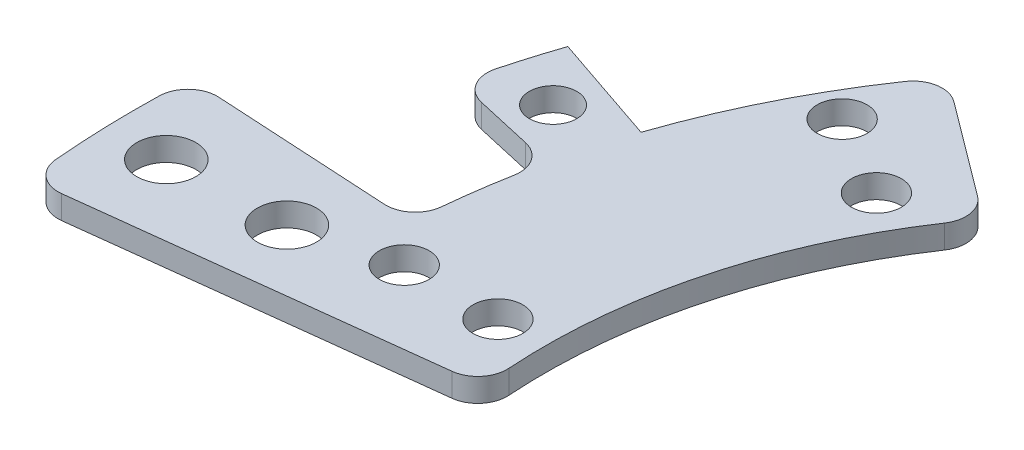
ISO-10303-21;
HEADER;
FILE_DESCRIPTION(('STEP AP214'),'2;1');
FILE_NAME('part.step','',(''),(''),'','','');
FILE_SCHEMA(('AUTOMOTIVE_DESIGN { 1 0 10303 214 1 1 1 1 }'));
ENDSEC;
DATA;
#1=APPLICATION_CONTEXT('core data for automotive mechanical design processes');
#2=APPLICATION_PROTOCOL_DEFINITION('international standard','automotive_design',2000,#1);
#3=PRODUCT_CONTEXT('',#1,'mechanical');
#4=PRODUCT('Part','Part','',(#3));
#5=PRODUCT_RELATED_PRODUCT_CATEGORY('part','',(#4));
#6=PRODUCT_DEFINITION_FORMATION('','',#4);
#7=PRODUCT_DEFINITION_CONTEXT('part definition',#1,'design');
#8=PRODUCT_DEFINITION('design','',#6,#7);
#9=PRODUCT_DEFINITION_SHAPE('','',#8);
#10=(LENGTH_UNIT() NAMED_UNIT(*) SI_UNIT(.MILLI.,.METRE.));
#11=(NAMED_UNIT(*) PLANE_ANGLE_UNIT() SI_UNIT($,.RADIAN.));
#12=(NAMED_UNIT(*) SI_UNIT($,.STERADIAN.) SOLID_ANGLE_UNIT());
#13=UNCERTAINTY_MEASURE_WITH_UNIT(LENGTH_MEASURE(1.E-05),#10,'distance_accuracy_value','');
#14=(GEOMETRIC_REPRESENTATION_CONTEXT(3) GLOBAL_UNCERTAINTY_ASSIGNED_CONTEXT((#13)) GLOBAL_UNIT_ASSIGNED_CONTEXT((#10,
#11,#12)) REPRESENTATION_CONTEXT('',''));
#15=CARTESIAN_POINT('',(0.,0.,0.));
#16=DIRECTION('',(0.,0.,1.));
#17=DIRECTION('',(1.,0.,0.));
#18=AXIS2_PLACEMENT_3D('',#15,#16,#17);
#19=CARTESIAN_POINT('',(0.,2.,0.));
#20=DIRECTION('',(0.,-1.,0.));
#21=DIRECTION('',(0.,0.,-1.));
#22=AXIS2_PLACEMENT_3D('',#19,#20,#21);
#23=CYLINDRICAL_SURFACE('',#22,62.);
#24=CARTESIAN_POINT('',(0.,0.,0.));
#25=DIRECTION('',(0.,1.,0.));
#26=DIRECTION('',(0.,0.,1.));
#27=AXIS2_PLACEMENT_3D('',#24,#25,#26);
#28=CIRCLE('',#27,62.);
#29=CARTESIAN_POINT('',(-60.9548901885019,0.,-11.3358441285893));
#30=VERTEX_POINT('',#29);
#31=CARTESIAN_POINT('',(-61.7181832198914,0.,-5.90473200373407));
#32=VERTEX_POINT('',#31);
#33=EDGE_CURVE('E240',#30,#32,#28,.T.);
#34=ORIENTED_EDGE('',*,*,#33,.T.);
#35=DIRECTION('',(0.,-1.,0.));
#36=VECTOR('',#35,1.);
#37=CARTESIAN_POINT('',(-61.7181832198913,2.,-5.90473200373407));
#38=LINE('',#37,#36);
#39=CARTESIAN_POINT('',(-61.7181832198914,2.,-5.90473200373407));
#40=VERTEX_POINT('',#39);
#41=EDGE_CURVE('E251',#32,#40,#38,.F.);
#42=ORIENTED_EDGE('',*,*,#41,.T.);
#43=CARTESIAN_POINT('',(0.,2.,0.));
#44=DIRECTION('',(0.,1.,0.));
#45=DIRECTION('',(0.,0.,1.));
#46=AXIS2_PLACEMENT_3D('',#43,#44,#45);
#47=CIRCLE('',#46,62.);
#48=CARTESIAN_POINT('',(-60.9548901885019,2.,-11.3358441285893));
#49=VERTEX_POINT('',#48);
#50=EDGE_CURVE('E174',#49,#40,#47,.T.);
#51=ORIENTED_EDGE('',*,*,#50,.F.);
#52=DIRECTION('',(0.,-1.,0.));
#53=VECTOR('',#52,1.);
#54=CARTESIAN_POINT('',(-60.9548901885019,2.,-11.3358441285893));
#55=LINE('',#54,#53);
#56=EDGE_CURVE('E248',#49,#30,#55,.T.);
#57=ORIENTED_EDGE('',*,*,#56,.T.);
#58=EDGE_LOOP('',(#34,#42,#51,#57));
#59=FACE_BOUND('',#58,.T.);
#60=ADVANCED_FACE('F35',(#59),#23,.T.);
#61=CARTESIAN_POINT('',(-51.1886642708847,2.,-34.9817187994337));
#62=VERTEX_POINT('',#61);
#63=CARTESIAN_POINT('',(-58.7074669335232,2.,-19.9357298900562));
#64=VERTEX_POINT('',#63);
#65=EDGE_CURVE('E160',#62,#64,#47,.T.);
#66=ORIENTED_EDGE('',*,*,#65,.F.);
#67=DIRECTION('',(0.,-1.,0.));
#68=VECTOR('',#67,1.);
#69=CARTESIAN_POINT('',(-51.1886642708847,2.,-34.9817187994337));
#70=LINE('',#69,#68);
#71=CARTESIAN_POINT('',(-51.1886642708847,0.,-34.9817187994337));
#72=VERTEX_POINT('',#71);
#73=EDGE_CURVE('E301',#62,#72,#70,.T.);
#74=ORIENTED_EDGE('',*,*,#73,.T.);
#75=CARTESIAN_POINT('',(-58.7074669335232,0.,-19.9357298900562));
#76=VERTEX_POINT('',#75);
#77=EDGE_CURVE('E189',#72,#76,#28,.T.);
#78=ORIENTED_EDGE('',*,*,#77,.T.);
#79=DIRECTION('',(0.,-1.,0.));
#80=VECTOR('',#79,1.);
#81=CARTESIAN_POINT('',(-58.7074669335232,16.9037007182661,-19.9357298900562));
#82=LINE('',#81,#80);
#83=EDGE_CURVE('E181',#64,#76,#82,.T.);
#84=ORIENTED_EDGE('',*,*,#83,.F.);
#85=EDGE_LOOP('',(#66,#74,#78,#84));
#86=FACE_BOUND('',#85,.T.);
#87=ADVANCED_FACE('F187',(#86),#23,.T.);
#88=CARTESIAN_POINT('',(0.,2.,0.));
#89=DIRECTION('',(0.,1.,0.));
#90=DIRECTION('',(0.,0.,1.));
#91=AXIS2_PLACEMENT_3D('',#88,#89,#90);
#92=PLANE('',#91);
#93=CARTESIAN_POINT('',(-64.4824921580959,2.,-18.1936308932854));
#94=DIRECTION('',(0.,1.,0.));
#95=DIRECTION('',(0.,0.,1.));
#96=AXIS2_PLACEMENT_3D('',#93,#94,#95);
#97=CIRCLE('',#96,2.02499999999999);
#98=CARTESIAN_POINT('',(-64.4824921580959,2.,-16.1686308932854));
#99=VERTEX_POINT('',#98);
#100=EDGE_CURVE('E191',#99,#99,#97,.T.);
#101=ORIENTED_EDGE('',*,*,#100,.F.);
#102=EDGE_LOOP('',(#101));
#103=FACE_BOUND('',#102,.T.);
#104=CARTESIAN_POINT('',(-44.1672955930063,2.,-25.5));
#105=DIRECTION('',(0.,1.,0.));
#106=DIRECTION('',(0.,0.,1.));
#107=AXIS2_PLACEMENT_3D('',#104,#105,#106);
#108=CIRCLE('',#107,2.125);
#109=CARTESIAN_POINT('',(-44.1672955930063,2.,-23.375));
#110=VERTEX_POINT('',#109);
#111=EDGE_CURVE('E208',#110,#110,#108,.T.);
#112=ORIENTED_EDGE('',*,*,#111,.F.);
#113=EDGE_LOOP('',(#112));
#114=FACE_BOUND('',#113,.T.);
#115=CARTESIAN_POINT('',(-51.0954988232818,2.,-29.5));
#116=DIRECTION('',(0.,1.,0.));
#117=DIRECTION('',(0.,0.,1.));
#118=AXIS2_PLACEMENT_3D('',#115,#116,#117);
#119=CIRCLE('',#118,2.125);
#120=CARTESIAN_POINT('',(-51.0954988232818,2.,-27.3750000000001));
#121=VERTEX_POINT('',#120);
#122=EDGE_CURVE('E220',#121,#121,#119,.T.);
#123=ORIENTED_EDGE('',*,*,#122,.F.);
#124=EDGE_LOOP('',(#123));
#125=FACE_BOUND('',#124,.T.);
#126=CARTESIAN_POINT('',(0.,2.,0.));
#127=DIRECTION('',(0.,1.,0.));
#128=DIRECTION('',(0.,0.,1.));
#129=AXIS2_PLACEMENT_3D('',#126,#127,#128);
#130=CIRCLE('',#129,82.);
#131=CARTESIAN_POINT('',(-81.9740451592876,2.,-2.06298817812173));
#132=VERTEX_POINT('',#131);
#133=CARTESIAN_POINT('',(-81.6936426156601,2.,7.08157865061171));
#134=VERTEX_POINT('',#133);
#135=EDGE_CURVE('E339',#132,#134,#130,.T.);
#136=ORIENTED_EDGE('',*,*,#135,.T.);
#137=CARTESIAN_POINT('',(-79.2029827798168,2.,6.86567686248331));
#138=DIRECTION('',(0.,1.,0.));
#139=DIRECTION('',(0.,0.,1.));
#140=AXIS2_PLACEMENT_3D('',#137,#138,#139);
#141=CIRCLE('',#140,2.5);
#142=CARTESIAN_POINT('',(-78.908865132758,2.,9.34831554132656));
#143=VERTEX_POINT('',#142);
#144=EDGE_CURVE('E283',#134,#143,#141,.T.);
#145=ORIENTED_EDGE('',*,*,#144,.T.);
#146=DIRECTION('',(0.993055471537302,0.,-0.117647058823529));
#147=VECTOR('',#146,1.);
#148=CARTESIAN_POINT('',(-46.6736071622532,2.,5.52941176470589));
#149=LINE('',#148,#147);
#150=CARTESIAN_POINT('',(-49.0935129154619,2.,5.81609745614508));
#151=VERTEX_POINT('',#150);
#152=EDGE_CURVE('E173',#143,#151,#149,.T.);
#153=ORIENTED_EDGE('',*,*,#152,.T.);
#154=CARTESIAN_POINT('',(-49.3876305625207,2.,3.33345877730183));
#155=DIRECTION('',(0.,1.,0.));
#156=DIRECTION('',(0.,0.,1.));
#157=AXIS2_PLACEMENT_3D('',#154,#155,#156);
#158=CIRCLE('',#157,2.5);
#159=CARTESIAN_POINT('',(-46.8933057866358,2.,3.16510227339769));
#160=VERTEX_POINT('',#159);
#161=EDGE_CURVE('E281',#151,#160,#158,.T.);
#162=ORIENTED_EDGE('',*,*,#161,.T.);
#163=CARTESIAN_POINT('',(0.,2.,0.));
#164=DIRECTION('',(0.,-1.,0.));
#165=DIRECTION('',(0.,0.,1.));
#166=AXIS2_PLACEMENT_3D('',#163,#164,#165);
#167=CIRCLE('',#166,47.);
#168=CARTESIAN_POINT('',(-39.0282429419596,2.,-26.1877118676562));
#169=VERTEX_POINT('',#168);
#170=EDGE_CURVE('E226',#160,#169,#167,.T.);
#171=ORIENTED_EDGE('',*,*,#170,.T.);
#172=CARTESIAN_POINT('',(-41.1042133112127,2.,-27.580675264872));
#173=DIRECTION('',(0.,1.,0.));
#174=DIRECTION('',(0.,0.,1.));
#175=AXIS2_PLACEMENT_3D('',#172,#173,#174);
#176=CIRCLE('',#175,2.5);
#177=CARTESIAN_POINT('',(-39.6081806177369,2.,-29.5836446056387));
#178=VERTEX_POINT('',#177);
#179=EDGE_CURVE('E276',#169,#178,#176,.T.);
#180=ORIENTED_EDGE('',*,*,#179,.T.);
#181=DIRECTION('',(-0.801187736306673,0.,-0.59841307739035));
#182=VECTOR('',#181,1.);
#183=CARTESIAN_POINT('',(-37.6558236064136,2.,-28.1254146373465));
#184=LINE('',#183,#182);
#185=CARTESIAN_POINT('',(-47.628572534228,2.,-35.5741349628039));
#186=VERTEX_POINT('',#185);
#187=EDGE_CURVE('E229',#178,#186,#184,.T.);
#188=ORIENTED_EDGE('',*,*,#187,.T.);
#189=CARTESIAN_POINT('',(-49.1246052277038,2.,-33.5711656220372));
#190=DIRECTION('',(0.,1.,0.));
#191=DIRECTION('',(0.,0.,1.));
#192=AXIS2_PLACEMENT_3D('',#189,#190,#191);
#193=CIRCLE('',#192,2.5);
#194=EDGE_CURVE('E168',#186,#62,#193,.T.);
#195=ORIENTED_EDGE('',*,*,#194,.T.);
#196=ORIENTED_EDGE('',*,*,#65,.T.);
#197=DIRECTION('',(-0.946894627960051,0.,-0.321544030484779));
#198=VECTOR('',#197,1.);
#199=CARTESIAN_POINT('',(-68.1764132131237,2.,-23.151170194904));
#200=LINE('',#199,#198);
#201=CARTESIAN_POINT('',(-68.1764132131237,2.,-23.151170194904));
#202=VERTEX_POINT('',#201);
#203=EDGE_CURVE('E165',#64,#202,#200,.T.);
#204=ORIENTED_EDGE('',*,*,#203,.T.);
#205=CARTESIAN_POINT('',(0.,2.,0.));
#206=DIRECTION('',(0.,1.,0.));
#207=DIRECTION('',(0.,0.,1.));
#208=AXIS2_PLACEMENT_3D('',#205,#206,#207);
#209=CIRCLE('',#208,72.);
#210=CARTESIAN_POINT('',(-69.6055760884792,2.,-18.4136845142664));
#211=VERTEX_POINT('',#210);
#212=EDGE_CURVE('E184',#202,#211,#209,.T.);
#213=ORIENTED_EDGE('',*,*,#212,.T.);
#214=CARTESIAN_POINT('',(-67.1887158076292,2.,-17.7743204686321));
#215=DIRECTION('',(0.,1.,0.));
#216=DIRECTION('',(0.,0.,1.));
#217=AXIS2_PLACEMENT_3D('',#214,#215,#216);
#218=CIRCLE('',#217,2.5);
#219=CARTESIAN_POINT('',(-67.7407286533917,2.,-15.3360256099013));
#220=VERTEX_POINT('',#219);
#221=EDGE_CURVE('E57',#211,#220,#218,.T.);
#222=ORIENTED_EDGE('',*,*,#221,.T.);
#223=DIRECTION('',(0.975317943492328,0.,0.220805138305015));
#224=VECTOR('',#223,1.);
#225=CARTESIAN_POINT('',(-70.2228919314476,2.,-15.897969957961));
#226=LINE('',#225,#224);
#227=CARTESIAN_POINT('',(-62.8607358180822,2.,-14.2312294763762));
#228=VERTEX_POINT('',#227);
#229=EDGE_CURVE('E185',#220,#228,#226,.T.);
#230=ORIENTED_EDGE('',*,*,#229,.T.);
#231=CARTESIAN_POINT('',(-63.4127486638447,2.,-11.7929346176453));
#232=DIRECTION('',(0.,1.,0.));
#233=DIRECTION('',(0.,0.,1.));
#234=AXIS2_PLACEMENT_3D('',#231,#232,#233);
#235=CIRCLE('',#234,2.5);
#236=EDGE_CURVE('E11',#228,#49,#235,.F.);
#237=ORIENTED_EDGE('',*,*,#236,.T.);
#238=ORIENTED_EDGE('',*,*,#50,.T.);
#239=CARTESIAN_POINT('',(-64.2068196400483,2.,-6.1428260361427));
#240=DIRECTION('',(0.,1.,0.));
#241=DIRECTION('',(0.,0.,1.));
#242=AXIS2_PLACEMENT_3D('',#239,#240,#241);
#243=CIRCLE('',#242,2.5);
#244=CARTESIAN_POINT('',(-64.3482759833136,2.,-3.64683122385843));
#245=VERTEX_POINT('',#244);
#246=EDGE_CURVE('E305',#40,#245,#243,.F.);
#247=ORIENTED_EDGE('',*,*,#246,.T.);
#248=DIRECTION('',(-0.998397924913709,0.,-0.0565825373061267));
#249=VECTOR('',#248,1.);
#250=CARTESIAN_POINT('',(-81.8686298429242,2.,-4.63976805910239));
#251=LINE('',#250,#249);
#252=CARTESIAN_POINT('',(-79.3333801221416,2.,-4.49608700936571));
#253=VERTEX_POINT('',#252);
#254=EDGE_CURVE('E331',#245,#253,#251,.T.);
#255=ORIENTED_EDGE('',*,*,#254,.T.);
#256=CARTESIAN_POINT('',(-79.4748364654069,2.,-2.00009219708143));
#257=DIRECTION('',(0.,1.,0.));
#258=DIRECTION('',(0.,0.,1.));
#259=AXIS2_PLACEMENT_3D('',#256,#257,#258);
#260=CIRCLE('',#259,2.5);
#261=EDGE_CURVE('E279',#253,#132,#260,.T.);
#262=ORIENTED_EDGE('',*,*,#261,.T.);
#263=EDGE_LOOP('',(#136,#145,#153,#162,#171,#180,#188,#195,#196,#204,#213,#222,#230,#237,#238,
#247,#255,#262));
#264=FACE_BOUND('',#263,.T.);
#265=CARTESIAN_POINT('',(-59.,2.,0.));
#266=DIRECTION('',(0.,1.,0.));
#267=DIRECTION('',(0.,0.,1.));
#268=AXIS2_PLACEMENT_3D('',#265,#266,#267);
#269=CIRCLE('',#268,2.125);
#270=CARTESIAN_POINT('',(-59.,2.,2.12500000000001));
#271=VERTEX_POINT('',#270);
#272=EDGE_CURVE('E214',#271,#271,#269,.T.);
#273=ORIENTED_EDGE('',*,*,#272,.F.);
#274=EDGE_LOOP('',(#273));
#275=FACE_BOUND('',#274,.T.);
#276=CARTESIAN_POINT('',(-51.,2.,0.));
#277=DIRECTION('',(0.,1.,0.));
#278=DIRECTION('',(0.,0.,1.));
#279=AXIS2_PLACEMENT_3D('',#276,#277,#278);
#280=CIRCLE('',#279,2.125);
#281=CARTESIAN_POINT('',(-51.,2.,2.12500000000001));
#282=VERTEX_POINT('',#281);
#283=EDGE_CURVE('E201',#282,#282,#280,.T.);
#284=ORIENTED_EDGE('',*,*,#283,.F.);
#285=EDGE_LOOP('',(#284));
#286=FACE_BOUND('',#285,.T.);
#287=CARTESIAN_POINT('',(-66.9685242341701,2.,2.05347556532022));
#288=DIRECTION('',(0.,1.,0.));
#289=DIRECTION('',(0.,0.,1.));
#290=AXIS2_PLACEMENT_3D('',#287,#288,#289);
#291=CIRCLE('',#290,2.52499999999999);
#292=CARTESIAN_POINT('',(-66.9685242341701,2.,4.57847556532022));
#293=VERTEX_POINT('',#292);
#294=EDGE_CURVE('E355',#293,#293,#291,.T.);
#295=ORIENTED_EDGE('',*,*,#294,.F.);
#296=EDGE_LOOP('',(#295));
#297=FACE_BOUND('',#296,.T.);
#298=CARTESIAN_POINT('',(-76.9638263586731,2.,2.35996445566653));
#299=DIRECTION('',(0.,1.,0.));
#300=DIRECTION('',(0.,0.,1.));
#301=AXIS2_PLACEMENT_3D('',#298,#299,#300);
#302=CIRCLE('',#301,2.52499999999999);
#303=CARTESIAN_POINT('',(-76.9638263586731,2.,4.88496445566652));
#304=VERTEX_POINT('',#303);
#305=EDGE_CURVE('E344',#304,#304,#302,.T.);
#306=ORIENTED_EDGE('',*,*,#305,.F.);
#307=EDGE_LOOP('',(#306));
#308=FACE_BOUND('',#307,.T.);
#309=ADVANCED_FACE('F163',(#103,#114,#125,#264,#275,#286,#297,#308),#92,.T.);
#310=CARTESIAN_POINT('',(0.,0.,0.));
#311=DIRECTION('',(0.,1.,0.));
#312=DIRECTION('',(0.,0.,1.));
#313=AXIS2_PLACEMENT_3D('',#310,#311,#312);
#314=PLANE('',#313);
#315=CARTESIAN_POINT('',(-64.4824921580959,0.,-18.1936308932854));
#316=DIRECTION('',(0.,1.,0.));
#317=DIRECTION('',(0.,0.,1.));
#318=AXIS2_PLACEMENT_3D('',#315,#316,#317);
#319=CIRCLE('',#318,2.02499999999999);
#320=CARTESIAN_POINT('',(-64.4824921580959,0.,-16.1686308932854));
#321=VERTEX_POINT('',#320);
#322=EDGE_CURVE('E195',#321,#321,#319,.T.);
#323=ORIENTED_EDGE('',*,*,#322,.T.);
#324=EDGE_LOOP('',(#323));
#325=FACE_BOUND('',#324,.T.);
#326=DIRECTION('',(0.993055471537302,0.,-0.117647058823529));
#327=VECTOR('',#326,1.);
#328=CARTESIAN_POINT('',(-46.6736071622532,0.,5.52941176470589));
#329=LINE('',#328,#327);
#330=CARTESIAN_POINT('',(-78.908865132758,0.,9.34831554132656));
#331=VERTEX_POINT('',#330);
#332=CARTESIAN_POINT('',(-49.0935129154619,0.,5.81609745614508));
#333=VERTEX_POINT('',#332);
#334=EDGE_CURVE('E230',#331,#333,#329,.T.);
#335=ORIENTED_EDGE('',*,*,#334,.F.);
#336=CARTESIAN_POINT('',(-79.2029827798168,0.,6.86567686248331));
#337=DIRECTION('',(0.,1.,0.));
#338=DIRECTION('',(0.,0.,1.));
#339=AXIS2_PLACEMENT_3D('',#336,#337,#338);
#340=CIRCLE('',#339,2.5);
#341=CARTESIAN_POINT('',(-81.6936426156601,0.,7.08157865061171));
#342=VERTEX_POINT('',#341);
#343=EDGE_CURVE('E268',#331,#342,#340,.F.);
#344=ORIENTED_EDGE('',*,*,#343,.T.);
#345=CARTESIAN_POINT('',(0.,0.,0.));
#346=DIRECTION('',(0.,1.,0.));
#347=DIRECTION('',(0.,0.,-1.));
#348=AXIS2_PLACEMENT_3D('',#345,#346,#347);
#349=CIRCLE('',#348,82.);
#350=CARTESIAN_POINT('',(-81.9740451592876,0.,-2.06298817812173));
#351=VERTEX_POINT('',#350);
#352=EDGE_CURVE('E352',#351,#342,#349,.T.);
#353=ORIENTED_EDGE('',*,*,#352,.F.);
#354=CARTESIAN_POINT('',(-79.4748364654069,0.,-2.00009219708143));
#355=DIRECTION('',(0.,1.,0.));
#356=DIRECTION('',(0.,0.,1.));
#357=AXIS2_PLACEMENT_3D('',#354,#355,#356);
#358=CIRCLE('',#357,2.5);
#359=CARTESIAN_POINT('',(-79.3333801221416,0.,-4.49608700936571));
#360=VERTEX_POINT('',#359);
#361=EDGE_CURVE('E264',#351,#360,#358,.F.);
#362=ORIENTED_EDGE('',*,*,#361,.T.);
#363=DIRECTION('',(-0.998397924913709,0.,-0.0565825373061267));
#364=VECTOR('',#363,1.);
#365=CARTESIAN_POINT('',(-81.8686298429242,0.,-4.63976805910239));
#366=LINE('',#365,#364);
#367=CARTESIAN_POINT('',(-64.3482759833136,0.,-3.64683122385843));
#368=VERTEX_POINT('',#367);
#369=EDGE_CURVE('E350',#368,#360,#366,.T.);
#370=ORIENTED_EDGE('',*,*,#369,.F.);
#371=CARTESIAN_POINT('',(-64.2068196400483,0.,-6.1428260361427));
#372=DIRECTION('',(0.,1.,0.));
#373=DIRECTION('',(0.,0.,1.));
#374=AXIS2_PLACEMENT_3D('',#371,#372,#373);
#375=CIRCLE('',#374,2.5);
#376=EDGE_CURVE('E303',#368,#32,#375,.T.);
#377=ORIENTED_EDGE('',*,*,#376,.T.);
#378=ORIENTED_EDGE('',*,*,#33,.F.);
#379=CARTESIAN_POINT('',(-63.4127486638447,0.,-11.7929346176453));
#380=DIRECTION('',(0.,1.,0.));
#381=DIRECTION('',(0.,0.,1.));
#382=AXIS2_PLACEMENT_3D('',#379,#380,#381);
#383=CIRCLE('',#382,2.5);
#384=CARTESIAN_POINT('',(-62.8607358180822,0.,-14.2312294763762));
#385=VERTEX_POINT('',#384);
#386=EDGE_CURVE('E43',#30,#385,#383,.T.);
#387=ORIENTED_EDGE('',*,*,#386,.T.);
#388=DIRECTION('',(0.975317943492328,0.,0.220805138305015));
#389=VECTOR('',#388,1.);
#390=CARTESIAN_POINT('',(-70.2228919314476,0.,-15.897969957961));
#391=LINE('',#390,#389);
#392=CARTESIAN_POINT('',(-67.7407286533917,0.,-15.3360256099013));
#393=VERTEX_POINT('',#392);
#394=EDGE_CURVE('E312',#393,#385,#391,.T.);
#395=ORIENTED_EDGE('',*,*,#394,.F.);
#396=CARTESIAN_POINT('',(-67.1887158076292,0.,-17.7743204686321));
#397=DIRECTION('',(0.,1.,0.));
#398=DIRECTION('',(0.,0.,1.));
#399=AXIS2_PLACEMENT_3D('',#396,#397,#398);
#400=CIRCLE('',#399,2.5);
#401=CARTESIAN_POINT('',(-69.6055760884792,0.,-18.4136845142664));
#402=VERTEX_POINT('',#401);
#403=EDGE_CURVE('E262',#393,#402,#400,.F.);
#404=ORIENTED_EDGE('',*,*,#403,.T.);
#405=CARTESIAN_POINT('',(0.,0.,0.));
#406=DIRECTION('',(0.,1.,0.));
#407=DIRECTION('',(0.,0.,-1.));
#408=AXIS2_PLACEMENT_3D('',#405,#406,#407);
#409=CIRCLE('',#408,72.);
#410=CARTESIAN_POINT('',(-68.1764132131237,0.,-23.151170194904));
#411=VERTEX_POINT('',#410);
#412=EDGE_CURVE('E200',#411,#402,#409,.T.);
#413=ORIENTED_EDGE('',*,*,#412,.F.);
#414=DIRECTION('',(-0.946894627960051,0.,-0.321544030484779));
#415=VECTOR('',#414,1.);
#416=CARTESIAN_POINT('',(-68.1764132131237,0.,-23.151170194904));
#417=LINE('',#416,#415);
#418=EDGE_CURVE('E190',#76,#411,#417,.T.);
#419=ORIENTED_EDGE('',*,*,#418,.F.);
#420=ORIENTED_EDGE('',*,*,#77,.F.);
#421=CARTESIAN_POINT('',(-49.1246052277038,0.,-33.5711656220372));
#422=DIRECTION('',(0.,1.,0.));
#423=DIRECTION('',(0.,0.,1.));
#424=AXIS2_PLACEMENT_3D('',#421,#422,#423);
#425=CIRCLE('',#424,2.5);
#426=CARTESIAN_POINT('',(-47.628572534228,0.,-35.5741349628039));
#427=VERTEX_POINT('',#426);
#428=EDGE_CURVE('E258',#72,#427,#425,.F.);
#429=ORIENTED_EDGE('',*,*,#428,.T.);
#430=DIRECTION('',(-0.801187736306673,0.,-0.59841307739035));
#431=VECTOR('',#430,1.);
#432=CARTESIAN_POINT('',(-37.6558236064136,0.,-28.1254146373465));
#433=LINE('',#432,#431);
#434=CARTESIAN_POINT('',(-39.6081806177369,0.,-29.5836446056387));
#435=VERTEX_POINT('',#434);
#436=EDGE_CURVE('E237',#435,#427,#433,.T.);
#437=ORIENTED_EDGE('',*,*,#436,.F.);
#438=CARTESIAN_POINT('',(-41.1042133112127,0.,-27.580675264872));
#439=DIRECTION('',(0.,1.,0.));
#440=DIRECTION('',(0.,0.,1.));
#441=AXIS2_PLACEMENT_3D('',#438,#439,#440);
#442=CIRCLE('',#441,2.5);
#443=CARTESIAN_POINT('',(-39.0282429419596,0.,-26.1877118676562));
#444=VERTEX_POINT('',#443);
#445=EDGE_CURVE('E260',#435,#444,#442,.F.);
#446=ORIENTED_EDGE('',*,*,#445,.T.);
#447=CARTESIAN_POINT('',(0.,0.,0.));
#448=DIRECTION('',(0.,-1.,0.));
#449=DIRECTION('',(0.,0.,1.));
#450=AXIS2_PLACEMENT_3D('',#447,#448,#449);
#451=CIRCLE('',#450,47.);
#452=CARTESIAN_POINT('',(-46.8933057866358,0.,3.16510227339769));
#453=VERTEX_POINT('',#452);
#454=EDGE_CURVE('E223',#453,#444,#451,.T.);
#455=ORIENTED_EDGE('',*,*,#454,.F.);
#456=CARTESIAN_POINT('',(-49.3876305625207,0.,3.33345877730183));
#457=DIRECTION('',(0.,1.,0.));
#458=DIRECTION('',(0.,0.,1.));
#459=AXIS2_PLACEMENT_3D('',#456,#457,#458);
#460=CIRCLE('',#459,2.5);
#461=EDGE_CURVE('E266',#453,#333,#460,.F.);
#462=ORIENTED_EDGE('',*,*,#461,.T.);
#463=EDGE_LOOP('',(#335,#344,#353,#362,#370,#377,#378,#387,#395,#404,#413,#419,#420,#429,#437,
#446,#455,#462));
#464=FACE_BOUND('',#463,.T.);
#465=CARTESIAN_POINT('',(-51.0954988232818,0.,-29.5));
#466=DIRECTION('',(0.,1.,0.));
#467=DIRECTION('',(0.,0.,1.));
#468=AXIS2_PLACEMENT_3D('',#465,#466,#467);
#469=CIRCLE('',#468,2.125);
#470=CARTESIAN_POINT('',(-51.0954988232818,0.,-27.3750000000001));
#471=VERTEX_POINT('',#470);
#472=EDGE_CURVE('E217',#471,#471,#469,.T.);
#473=ORIENTED_EDGE('',*,*,#472,.T.);
#474=EDGE_LOOP('',(#473));
#475=FACE_BOUND('',#474,.T.);
#476=CARTESIAN_POINT('',(-59.,0.,0.));
#477=DIRECTION('',(0.,1.,0.));
#478=DIRECTION('',(0.,0.,1.));
#479=AXIS2_PLACEMENT_3D('',#476,#477,#478);
#480=CIRCLE('',#479,2.125);
#481=CARTESIAN_POINT('',(-59.,0.,2.12500000000001));
#482=VERTEX_POINT('',#481);
#483=EDGE_CURVE('E211',#482,#482,#480,.T.);
#484=ORIENTED_EDGE('',*,*,#483,.T.);
#485=EDGE_LOOP('',(#484));
#486=FACE_BOUND('',#485,.T.);
#487=CARTESIAN_POINT('',(-44.1672955930063,0.,-25.5));
#488=DIRECTION('',(0.,1.,0.));
#489=DIRECTION('',(0.,0.,1.));
#490=AXIS2_PLACEMENT_3D('',#487,#488,#489);
#491=CIRCLE('',#490,2.125);
#492=CARTESIAN_POINT('',(-44.1672955930063,0.,-23.375));
#493=VERTEX_POINT('',#492);
#494=EDGE_CURVE('E204',#493,#493,#491,.T.);
#495=ORIENTED_EDGE('',*,*,#494,.T.);
#496=EDGE_LOOP('',(#495));
#497=FACE_BOUND('',#496,.T.);
#498=CARTESIAN_POINT('',(-51.,0.,0.));
#499=DIRECTION('',(0.,1.,0.));
#500=DIRECTION('',(0.,0.,1.));
#501=AXIS2_PLACEMENT_3D('',#498,#499,#500);
#502=CIRCLE('',#501,2.125);
#503=CARTESIAN_POINT('',(-51.,0.,2.12500000000001));
#504=VERTEX_POINT('',#503);
#505=EDGE_CURVE('E205',#504,#504,#502,.T.);
#506=ORIENTED_EDGE('',*,*,#505,.T.);
#507=EDGE_LOOP('',(#506));
#508=FACE_BOUND('',#507,.T.);
#509=CARTESIAN_POINT('',(-76.9638263586731,0.,2.35996445566653));
#510=DIRECTION('',(0.,1.,0.));
#511=DIRECTION('',(0.,0.,1.));
#512=AXIS2_PLACEMENT_3D('',#509,#510,#511);
#513=CIRCLE('',#512,2.52499999999999);
#514=CARTESIAN_POINT('',(-76.9638263586731,0.,4.88496445566652));
#515=VERTEX_POINT('',#514);
#516=EDGE_CURVE('E342',#515,#515,#513,.T.);
#517=ORIENTED_EDGE('',*,*,#516,.T.);
#518=EDGE_LOOP('',(#517));
#519=FACE_BOUND('',#518,.T.);
#520=CARTESIAN_POINT('',(-66.9685242341701,0.,2.05347556532022));
#521=DIRECTION('',(0.,1.,0.));
#522=DIRECTION('',(0.,0.,1.));
#523=AXIS2_PLACEMENT_3D('',#520,#521,#522);
#524=CIRCLE('',#523,2.52499999999999);
#525=CARTESIAN_POINT('',(-66.9685242341701,0.,4.57847556532022));
#526=VERTEX_POINT('',#525);
#527=EDGE_CURVE('E338',#526,#526,#524,.T.);
#528=ORIENTED_EDGE('',*,*,#527,.T.);
#529=EDGE_LOOP('',(#528));
#530=FACE_BOUND('',#529,.T.);
#531=ADVANCED_FACE('F310',(#325,#464,#475,#486,#497,#508,#519,#530),#314,.F.);
#532=CARTESIAN_POINT('',(0.,2.,0.));
#533=DIRECTION('',(0.,-1.,0.));
#534=DIRECTION('',(0.,0.,-1.));
#535=AXIS2_PLACEMENT_3D('',#532,#533,#534);
#536=CYLINDRICAL_SURFACE('',#535,47.);
#537=ORIENTED_EDGE('',*,*,#170,.F.);
#538=DIRECTION('',(0.,-1.,0.));
#539=VECTOR('',#538,1.);
#540=CARTESIAN_POINT('',(-46.8933057866358,2.,3.16510227339769));
#541=LINE('',#540,#539);
#542=EDGE_CURVE('E287',#160,#453,#541,.T.);
#543=ORIENTED_EDGE('',*,*,#542,.T.);
#544=ORIENTED_EDGE('',*,*,#454,.T.);
#545=DIRECTION('',(0.,-1.,0.));
#546=VECTOR('',#545,1.);
#547=CARTESIAN_POINT('',(-39.0282429419596,2.,-26.1877118676562));
#548=LINE('',#547,#546);
#549=EDGE_CURVE('E285',#444,#169,#548,.F.);
#550=ORIENTED_EDGE('',*,*,#549,.T.);
#551=EDGE_LOOP('',(#537,#543,#544,#550));
#552=FACE_BOUND('',#551,.T.);
#553=ADVANCED_FACE('F392',(#552),#536,.F.);
#554=CARTESIAN_POINT('',(-37.6558236064136,2.,-28.1254146373465));
#555=DIRECTION('',(-0.59841307739035,0.,0.801187736306673));
#556=DIRECTION('',(0.801187736306673,0.,0.59841307739035));
#557=AXIS2_PLACEMENT_3D('',#554,#555,#556);
#558=PLANE('',#557);
#559=ORIENTED_EDGE('',*,*,#187,.F.);
#560=DIRECTION('',(0.,-1.,0.));
#561=VECTOR('',#560,1.);
#562=CARTESIAN_POINT('',(-39.6081806177369,2.,-29.5836446056387));
#563=LINE('',#562,#561);
#564=EDGE_CURVE('E298',#178,#435,#563,.T.);
#565=ORIENTED_EDGE('',*,*,#564,.T.);
#566=ORIENTED_EDGE('',*,*,#436,.T.);
#567=DIRECTION('',(0.,-1.,0.));
#568=VECTOR('',#567,1.);
#569=CARTESIAN_POINT('',(-47.628572534228,2.,-35.5741349628039));
#570=LINE('',#569,#568);
#571=EDGE_CURVE('E296',#427,#186,#570,.F.);
#572=ORIENTED_EDGE('',*,*,#571,.T.);
#573=EDGE_LOOP('',(#559,#565,#566,#572));
#574=FACE_BOUND('',#573,.T.);
#575=ADVANCED_FACE('F373',(#574),#558,.F.);
#576=CARTESIAN_POINT('',(-46.6736071622532,2.,5.52941176470589));
#577=DIRECTION('',(-0.117647058823529,0.,-0.993055471537302));
#578=DIRECTION('',(-0.993055471537302,0.,0.117647058823529));
#579=AXIS2_PLACEMENT_3D('',#576,#577,#578);
#580=PLANE('',#579);
#581=ORIENTED_EDGE('',*,*,#152,.F.);
#582=DIRECTION('',(0.,-1.,0.));
#583=VECTOR('',#582,1.);
#584=CARTESIAN_POINT('',(-78.908865132758,2.,9.34831554132656));
#585=LINE('',#584,#583);
#586=EDGE_CURVE('E255',#143,#331,#585,.T.);
#587=ORIENTED_EDGE('',*,*,#586,.T.);
#588=ORIENTED_EDGE('',*,*,#334,.T.);
#589=DIRECTION('',(0.,-1.,0.));
#590=VECTOR('',#589,1.);
#591=CARTESIAN_POINT('',(-49.0935129154619,2.,5.81609745614508));
#592=LINE('',#591,#590);
#593=EDGE_CURVE('E253',#333,#151,#592,.F.);
#594=ORIENTED_EDGE('',*,*,#593,.T.);
#595=EDGE_LOOP('',(#581,#587,#588,#594));
#596=FACE_BOUND('',#595,.T.);
#597=ADVANCED_FACE('F388',(#596),#580,.F.);
#598=CARTESIAN_POINT('',(-51.0954988232818,2.,-29.5));
#599=DIRECTION('',(0.,-1.,0.));
#600=DIRECTION('',(0.,0.,-1.));
#601=AXIS2_PLACEMENT_3D('',#598,#599,#600);
#602=CYLINDRICAL_SURFACE('',#601,2.125);
#603=ORIENTED_EDGE('',*,*,#122,.T.);
#604=EDGE_LOOP('',(#603));
#605=FACE_BOUND('',#604,.T.);
#606=ORIENTED_EDGE('',*,*,#472,.F.);
#607=EDGE_LOOP('',(#606));
#608=FACE_BOUND('',#607,.T.);
#609=ADVANCED_FACE('F499',(#605,#608),#602,.F.);
#610=CARTESIAN_POINT('',(-59.,2.,0.));
#611=DIRECTION('',(0.,-1.,0.));
#612=DIRECTION('',(0.,0.,-1.));
#613=AXIS2_PLACEMENT_3D('',#610,#611,#612);
#614=CYLINDRICAL_SURFACE('',#613,2.125);
#615=ORIENTED_EDGE('',*,*,#272,.T.);
#616=EDGE_LOOP('',(#615));
#617=FACE_BOUND('',#616,.T.);
#618=ORIENTED_EDGE('',*,*,#483,.F.);
#619=EDGE_LOOP('',(#618));
#620=FACE_BOUND('',#619,.T.);
#621=ADVANCED_FACE('F580',(#617,#620),#614,.F.);
#622=CARTESIAN_POINT('',(-44.1672955930063,2.,-25.5));
#623=DIRECTION('',(0.,-1.,0.));
#624=DIRECTION('',(0.,0.,-1.));
#625=AXIS2_PLACEMENT_3D('',#622,#623,#624);
#626=CYLINDRICAL_SURFACE('',#625,2.125);
#627=ORIENTED_EDGE('',*,*,#111,.T.);
#628=EDGE_LOOP('',(#627));
#629=FACE_BOUND('',#628,.T.);
#630=ORIENTED_EDGE('',*,*,#494,.F.);
#631=EDGE_LOOP('',(#630));
#632=FACE_BOUND('',#631,.T.);
#633=ADVANCED_FACE('F570',(#629,#632),#626,.F.);
#634=CARTESIAN_POINT('',(-51.,2.,0.));
#635=DIRECTION('',(0.,-1.,0.));
#636=DIRECTION('',(0.,0.,-1.));
#637=AXIS2_PLACEMENT_3D('',#634,#635,#636);
#638=CYLINDRICAL_SURFACE('',#637,2.125);
#639=ORIENTED_EDGE('',*,*,#283,.T.);
#640=EDGE_LOOP('',(#639));
#641=FACE_BOUND('',#640,.T.);
#642=ORIENTED_EDGE('',*,*,#505,.F.);
#643=EDGE_LOOP('',(#642));
#644=FACE_BOUND('',#643,.T.);
#645=ADVANCED_FACE('F561',(#641,#644),#638,.F.);
#646=CARTESIAN_POINT('',(-68.1764132131237,16.9037007182661,-23.151170194904));
#647=DIRECTION('',(-0.321544030484779,0.,0.946894627960051));
#648=DIRECTION('',(0.946894627960051,0.,0.321544030484779));
#649=AXIS2_PLACEMENT_3D('',#646,#647,#648);
#650=PLANE('',#649);
#651=ORIENTED_EDGE('',*,*,#203,.F.);
#652=ORIENTED_EDGE('',*,*,#83,.T.);
#653=ORIENTED_EDGE('',*,*,#418,.T.);
#654=DIRECTION('',(0.,-1.,0.));
#655=VECTOR('',#654,1.);
#656=CARTESIAN_POINT('',(-68.1764132131237,16.9037007182661,-23.151170194904));
#657=LINE('',#656,#655);
#658=EDGE_CURVE('E183',#202,#411,#657,.T.);
#659=ORIENTED_EDGE('',*,*,#658,.F.);
#660=EDGE_LOOP('',(#651,#652,#653,#659));
#661=FACE_BOUND('',#660,.T.);
#662=ADVANCED_FACE('F179',(#661),#650,.F.);
#663=CARTESIAN_POINT('',(0.,16.9037007182661,0.));
#664=DIRECTION('',(0.,-1.,0.));
#665=DIRECTION('',(0.,0.,-1.));
#666=AXIS2_PLACEMENT_3D('',#663,#664,#665);
#667=CYLINDRICAL_SURFACE('',#666,72.);
#668=ORIENTED_EDGE('',*,*,#412,.T.);
#669=DIRECTION('',(0.,-1.,0.));
#670=VECTOR('',#669,1.);
#671=CARTESIAN_POINT('',(-69.6055760884792,16.9037007182661,-18.4136845142664));
#672=LINE('',#671,#670);
#673=EDGE_CURVE('E294',#402,#211,#672,.F.);
#674=ORIENTED_EDGE('',*,*,#673,.T.);
#675=ORIENTED_EDGE('',*,*,#212,.F.);
#676=ORIENTED_EDGE('',*,*,#658,.T.);
#677=EDGE_LOOP('',(#668,#674,#675,#676));
#678=FACE_BOUND('',#677,.T.);
#679=ADVANCED_FACE('F367',(#678),#667,.T.);
#680=CARTESIAN_POINT('',(-70.2228919314476,16.9037007182661,-15.897969957961));
#681=DIRECTION('',(0.220805138305015,0.,-0.975317943492328));
#682=DIRECTION('',(-0.975317943492328,0.,-0.220805138305015));
#683=AXIS2_PLACEMENT_3D('',#680,#681,#682);
#684=PLANE('',#683);
#685=ORIENTED_EDGE('',*,*,#229,.F.);
#686=DIRECTION('',(0.,-1.,0.));
#687=VECTOR('',#686,1.);
#688=CARTESIAN_POINT('',(-67.7407286533917,16.9037007182661,-15.3360256099013));
#689=LINE('',#688,#687);
#690=EDGE_CURVE('E291',#220,#393,#689,.T.);
#691=ORIENTED_EDGE('',*,*,#690,.T.);
#692=ORIENTED_EDGE('',*,*,#394,.T.);
#693=DIRECTION('',(0.,1.,0.));
#694=VECTOR('',#693,1.);
#695=CARTESIAN_POINT('',(-62.8607358180822,2.,-14.2312294763762));
#696=LINE('',#695,#694);
#697=EDGE_CURVE('E50',#385,#228,#696,.T.);
#698=ORIENTED_EDGE('',*,*,#697,.T.);
#699=EDGE_LOOP('',(#685,#691,#692,#698));
#700=FACE_BOUND('',#699,.T.);
#701=ADVANCED_FACE('F316',(#700),#684,.F.);
#702=CARTESIAN_POINT('',(-64.4824921580959,0.,-18.1936308932854));
#703=DIRECTION('',(0.,1.,0.));
#704=DIRECTION('',(0.,0.,1.));
#705=AXIS2_PLACEMENT_3D('',#702,#703,#704);
#706=CYLINDRICAL_SURFACE('',#705,2.02499999999999);
#707=ORIENTED_EDGE('',*,*,#100,.T.);
#708=EDGE_LOOP('',(#707));
#709=FACE_BOUND('',#708,.T.);
#710=ORIENTED_EDGE('',*,*,#322,.F.);
#711=EDGE_LOOP('',(#710));
#712=FACE_BOUND('',#711,.T.);
#713=ADVANCED_FACE('F488',(#709,#712),#706,.F.);
#714=CARTESIAN_POINT('',(-76.9638263586731,26.930327625883,2.35996445566653));
#715=DIRECTION('',(0.,-1.,0.));
#716=DIRECTION('',(0.,0.,-1.));
#717=AXIS2_PLACEMENT_3D('',#714,#715,#716);
#718=CYLINDRICAL_SURFACE('',#717,2.52499999999999);
#719=ORIENTED_EDGE('',*,*,#516,.F.);
#720=EDGE_LOOP('',(#719));
#721=FACE_BOUND('',#720,.T.);
#722=ORIENTED_EDGE('',*,*,#305,.T.);
#723=EDGE_LOOP('',(#722));
#724=FACE_BOUND('',#723,.T.);
#725=ADVANCED_FACE('F479',(#721,#724),#718,.F.);
#726=CARTESIAN_POINT('',(0.,26.930327625883,0.));
#727=DIRECTION('',(0.,-1.,0.));
#728=DIRECTION('',(0.,0.,-1.));
#729=AXIS2_PLACEMENT_3D('',#726,#727,#728);
#730=CYLINDRICAL_SURFACE('',#729,82.);
#731=ORIENTED_EDGE('',*,*,#352,.T.);
#732=DIRECTION('',(0.,-1.,0.));
#733=VECTOR('',#732,1.);
#734=CARTESIAN_POINT('',(-81.6936426156601,26.930327625883,7.08157865061172));
#735=LINE('',#734,#733);
#736=EDGE_CURVE('E273',#342,#134,#735,.F.);
#737=ORIENTED_EDGE('',*,*,#736,.T.);
#738=ORIENTED_EDGE('',*,*,#135,.F.);
#739=DIRECTION('',(0.,-1.,0.));
#740=VECTOR('',#739,1.);
#741=CARTESIAN_POINT('',(-81.9740451592876,26.930327625883,-2.06298817812173));
#742=LINE('',#741,#740);
#743=EDGE_CURVE('E270',#132,#351,#742,.T.);
#744=ORIENTED_EDGE('',*,*,#743,.T.);
#745=EDGE_LOOP('',(#731,#737,#738,#744));
#746=FACE_BOUND('',#745,.T.);
#747=ADVANCED_FACE('F471',(#746),#730,.T.);
#748=CARTESIAN_POINT('',(-81.8686298429242,26.930327625883,-4.63976805910239));
#749=DIRECTION('',(-0.0565825373061267,0.,0.998397924913709));
#750=DIRECTION('',(0.998397924913709,0.,0.0565825373061267));
#751=AXIS2_PLACEMENT_3D('',#748,#749,#750);
#752=PLANE('',#751);
#753=ORIENTED_EDGE('',*,*,#254,.F.);
#754=DIRECTION('',(0.,1.,0.));
#755=VECTOR('',#754,1.);
#756=CARTESIAN_POINT('',(-64.3482759833136,0.,-3.64683122385843));
#757=LINE('',#756,#755);
#758=EDGE_CURVE('E245',#245,#368,#757,.F.);
#759=ORIENTED_EDGE('',*,*,#758,.T.);
#760=ORIENTED_EDGE('',*,*,#369,.T.);
#761=DIRECTION('',(0.,-1.,0.));
#762=VECTOR('',#761,1.);
#763=CARTESIAN_POINT('',(-79.3333801221416,26.930327625883,-4.49608700936571));
#764=LINE('',#763,#762);
#765=EDGE_CURVE('E234',#360,#253,#764,.F.);
#766=ORIENTED_EDGE('',*,*,#765,.T.);
#767=EDGE_LOOP('',(#753,#759,#760,#766));
#768=FACE_BOUND('',#767,.T.);
#769=ADVANCED_FACE('F334',(#768),#752,.F.);
#770=CARTESIAN_POINT('',(-66.9685242341701,26.930327625883,2.05347556532022));
#771=DIRECTION('',(0.,-1.,0.));
#772=DIRECTION('',(0.,0.,-1.));
#773=AXIS2_PLACEMENT_3D('',#770,#771,#772);
#774=CYLINDRICAL_SURFACE('',#773,2.52499999999999);
#775=ORIENTED_EDGE('',*,*,#527,.F.);
#776=EDGE_LOOP('',(#775));
#777=FACE_BOUND('',#776,.T.);
#778=ORIENTED_EDGE('',*,*,#294,.T.);
#779=EDGE_LOOP('',(#778));
#780=FACE_BOUND('',#779,.T.);
#781=ADVANCED_FACE('F399',(#777,#780),#774,.F.);
#782=CARTESIAN_POINT('',(-64.2068196400483,2.,-6.1428260361427));
#783=DIRECTION('',(0.,-1.,0.));
#784=DIRECTION('',(0.,0.,-1.));
#785=AXIS2_PLACEMENT_3D('',#782,#783,#784);
#786=CYLINDRICAL_SURFACE('',#785,2.5);
#787=ORIENTED_EDGE('',*,*,#246,.F.);
#788=ORIENTED_EDGE('',*,*,#41,.F.);
#789=ORIENTED_EDGE('',*,*,#376,.F.);
#790=ORIENTED_EDGE('',*,*,#758,.F.);
#791=EDGE_LOOP('',(#787,#788,#789,#790));
#792=FACE_BOUND('',#791,.T.);
#793=ADVANCED_FACE('F327',(#792),#786,.F.);
#794=CARTESIAN_POINT('',(-79.2029827798168,26.930327625883,6.86567686248331));
#795=DIRECTION('',(0.,-1.,0.));
#796=DIRECTION('',(0.,0.,-1.));
#797=AXIS2_PLACEMENT_3D('',#794,#795,#796);
#798=CYLINDRICAL_SURFACE('',#797,2.5);
#799=ORIENTED_EDGE('',*,*,#144,.F.);
#800=ORIENTED_EDGE('',*,*,#736,.F.);
#801=ORIENTED_EDGE('',*,*,#343,.F.);
#802=ORIENTED_EDGE('',*,*,#586,.F.);
#803=EDGE_LOOP('',(#799,#800,#801,#802));
#804=FACE_BOUND('',#803,.T.);
#805=ADVANCED_FACE('F398',(#804),#798,.T.);
#806=CARTESIAN_POINT('',(-49.3876305625207,2.,3.33345877730183));
#807=DIRECTION('',(0.,-1.,0.));
#808=DIRECTION('',(0.,0.,-1.));
#809=AXIS2_PLACEMENT_3D('',#806,#807,#808);
#810=CYLINDRICAL_SURFACE('',#809,2.5);
#811=ORIENTED_EDGE('',*,*,#161,.F.);
#812=ORIENTED_EDGE('',*,*,#593,.F.);
#813=ORIENTED_EDGE('',*,*,#461,.F.);
#814=ORIENTED_EDGE('',*,*,#542,.F.);
#815=EDGE_LOOP('',(#811,#812,#813,#814));
#816=FACE_BOUND('',#815,.T.);
#817=ADVANCED_FACE('F402',(#816),#810,.T.);
#818=CARTESIAN_POINT('',(-79.4748364654069,26.930327625883,-2.00009219708143));
#819=DIRECTION('',(0.,-1.,0.));
#820=DIRECTION('',(0.,0.,-1.));
#821=AXIS2_PLACEMENT_3D('',#818,#819,#820);
#822=CYLINDRICAL_SURFACE('',#821,2.5);
#823=ORIENTED_EDGE('',*,*,#261,.F.);
#824=ORIENTED_EDGE('',*,*,#765,.F.);
#825=ORIENTED_EDGE('',*,*,#361,.F.);
#826=ORIENTED_EDGE('',*,*,#743,.F.);
#827=EDGE_LOOP('',(#823,#824,#825,#826));
#828=FACE_BOUND('',#827,.T.);
#829=ADVANCED_FACE('F406',(#828),#822,.T.);
#830=CARTESIAN_POINT('',(-67.1887158076292,16.9037007182661,-17.7743204686321));
#831=DIRECTION('',(0.,-1.,0.));
#832=DIRECTION('',(0.,0.,-1.));
#833=AXIS2_PLACEMENT_3D('',#830,#831,#832);
#834=CYLINDRICAL_SURFACE('',#833,2.5);
#835=ORIENTED_EDGE('',*,*,#221,.F.);
#836=ORIENTED_EDGE('',*,*,#673,.F.);
#837=ORIENTED_EDGE('',*,*,#403,.F.);
#838=ORIENTED_EDGE('',*,*,#690,.F.);
#839=EDGE_LOOP('',(#835,#836,#837,#838));
#840=FACE_BOUND('',#839,.T.);
#841=ADVANCED_FACE('F365',(#840),#834,.T.);
#842=CARTESIAN_POINT('',(-63.4127486638447,2.,-11.7929346176453));
#843=DIRECTION('',(0.,-1.,0.));
#844=DIRECTION('',(0.,0.,-1.));
#845=AXIS2_PLACEMENT_3D('',#842,#843,#844);
#846=CYLINDRICAL_SURFACE('',#845,2.5);
#847=ORIENTED_EDGE('',*,*,#236,.F.);
#848=ORIENTED_EDGE('',*,*,#697,.F.);
#849=ORIENTED_EDGE('',*,*,#386,.F.);
#850=ORIENTED_EDGE('',*,*,#56,.F.);
#851=EDGE_LOOP('',(#847,#848,#849,#850));
#852=FACE_BOUND('',#851,.T.);
#853=ADVANCED_FACE('F320',(#852),#846,.F.);
#854=CARTESIAN_POINT('',(-41.1042133112127,2.,-27.580675264872));
#855=DIRECTION('',(0.,-1.,0.));
#856=DIRECTION('',(0.,0.,-1.));
#857=AXIS2_PLACEMENT_3D('',#854,#855,#856);
#858=CYLINDRICAL_SURFACE('',#857,2.5);
#859=ORIENTED_EDGE('',*,*,#179,.F.);
#860=ORIENTED_EDGE('',*,*,#549,.F.);
#861=ORIENTED_EDGE('',*,*,#445,.F.);
#862=ORIENTED_EDGE('',*,*,#564,.F.);
#863=EDGE_LOOP('',(#859,#860,#861,#862));
#864=FACE_BOUND('',#863,.T.);
#865=ADVANCED_FACE('F376',(#864),#858,.T.);
#866=CARTESIAN_POINT('',(-49.1246052277038,2.,-33.5711656220372));
#867=DIRECTION('',(0.,-1.,0.));
#868=DIRECTION('',(0.,0.,-1.));
#869=AXIS2_PLACEMENT_3D('',#866,#867,#868);
#870=CYLINDRICAL_SURFACE('',#869,2.5);
#871=ORIENTED_EDGE('',*,*,#194,.F.);
#872=ORIENTED_EDGE('',*,*,#571,.F.);
#873=ORIENTED_EDGE('',*,*,#428,.F.);
#874=ORIENTED_EDGE('',*,*,#73,.F.);
#875=EDGE_LOOP('',(#871,#872,#873,#874));
#876=FACE_BOUND('',#875,.T.);
#877=ADVANCED_FACE('F37',(#876),#870,.T.);
#878=CLOSED_SHELL('',(#60,#87,#309,#531,#553,#575,#597,#609,#621,#633,#645,#662,#679,#701,#713,
#725,#747,#769,#781,#793,#805,#817,#829,#841,#853,#865,#877));
#879=MANIFOLD_SOLID_BREP('B2',#878);
#880=ADVANCED_BREP_SHAPE_REPRESENTATION('',(#18,#879),#14);
#881=SHAPE_DEFINITION_REPRESENTATION(#9,#880);
ENDSEC;
END-ISO-10303-21;
